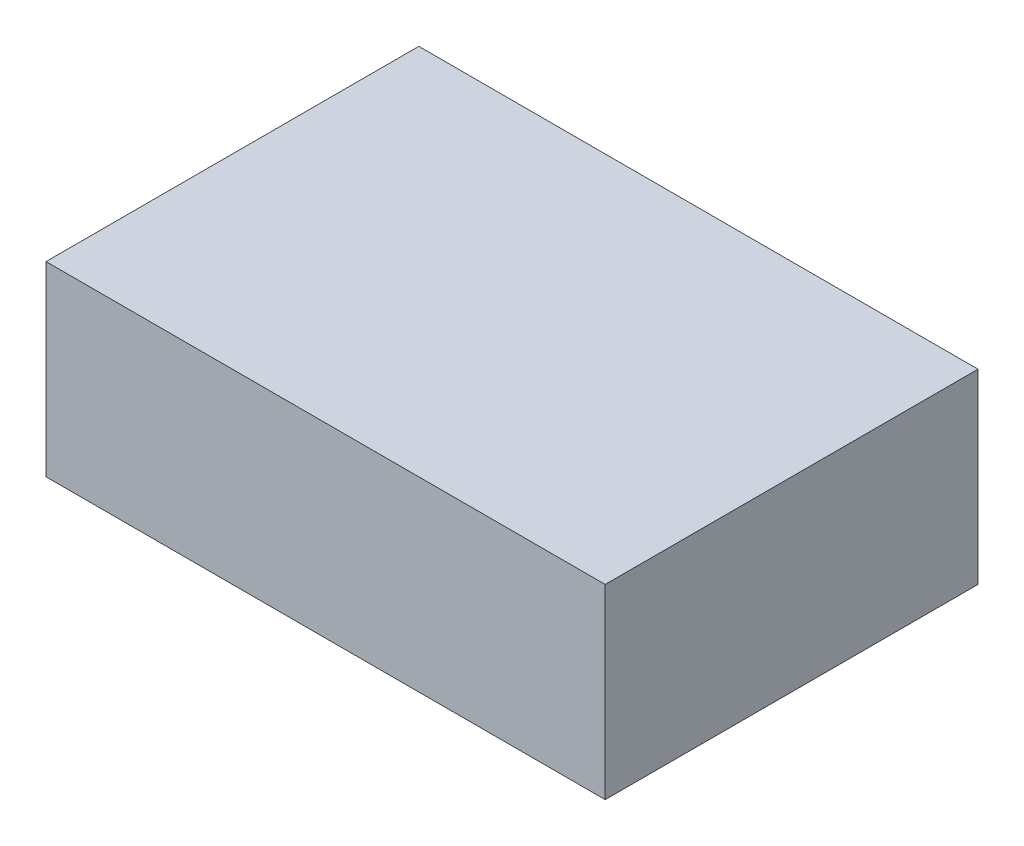
ISO-10303-21;
HEADER;
FILE_DESCRIPTION(('STEP AP214'),'2;1');
FILE_NAME('part.step','',(''),(''),'','','');
FILE_SCHEMA(('AUTOMOTIVE_DESIGN { 1 0 10303 214 1 1 1 1 }'));
ENDSEC;
DATA;
#1=APPLICATION_CONTEXT('core data for automotive mechanical design processes');
#2=APPLICATION_PROTOCOL_DEFINITION('international standard','automotive_design',2000,#1);
#3=PRODUCT_CONTEXT('',#1,'mechanical');
#4=PRODUCT('Part','Part','',(#3));
#5=PRODUCT_RELATED_PRODUCT_CATEGORY('part','',(#4));
#6=PRODUCT_DEFINITION_FORMATION('','',#4);
#7=PRODUCT_DEFINITION_CONTEXT('part definition',#1,'design');
#8=PRODUCT_DEFINITION('design','',#6,#7);
#9=PRODUCT_DEFINITION_SHAPE('','',#8);
#10=(LENGTH_UNIT() NAMED_UNIT(*) SI_UNIT(.MILLI.,.METRE.));
#11=(NAMED_UNIT(*) PLANE_ANGLE_UNIT() SI_UNIT($,.RADIAN.));
#12=(NAMED_UNIT(*) SI_UNIT($,.STERADIAN.) SOLID_ANGLE_UNIT());
#13=UNCERTAINTY_MEASURE_WITH_UNIT(LENGTH_MEASURE(1.E-05),#10,'distance_accuracy_value','');
#14=(GEOMETRIC_REPRESENTATION_CONTEXT(3) GLOBAL_UNCERTAINTY_ASSIGNED_CONTEXT((#13)) GLOBAL_UNIT_ASSIGNED_CONTEXT((#10,
#11,#12)) REPRESENTATION_CONTEXT('',''));
#15=CARTESIAN_POINT('',(0.,0.,0.));
#16=DIRECTION('',(0.,0.,1.));
#17=DIRECTION('',(1.,0.,0.));
#18=AXIS2_PLACEMENT_3D('',#15,#16,#17);
#19=CARTESIAN_POINT('',(152.4,101.6,-101.6));
#20=DIRECTION('',(-1.,0.,0.));
#21=DIRECTION('',(0.,0.,1.));
#22=AXIS2_PLACEMENT_3D('',#19,#20,#21);
#23=PLANE('',#22);
#24=DIRECTION('',(0.,0.,-1.));
#25=VECTOR('',#24,1.);
#26=CARTESIAN_POINT('',(152.4,0.,-101.6));
#27=LINE('',#26,#25);
#28=CARTESIAN_POINT('',(152.4,0.,101.6));
#29=VERTEX_POINT('',#28);
#30=CARTESIAN_POINT('',(152.4,0.,-101.6));
#31=VERTEX_POINT('',#30);
#32=EDGE_CURVE('E100',#29,#31,#27,.T.);
#33=ORIENTED_EDGE('',*,*,#32,.T.);
#34=DIRECTION('',(0.,-1.,0.));
#35=VECTOR('',#34,1.);
#36=CARTESIAN_POINT('',(152.4,101.6,-101.6));
#37=LINE('',#36,#35);
#38=CARTESIAN_POINT('',(152.4,101.6,-101.6));
#39=VERTEX_POINT('',#38);
#40=EDGE_CURVE('E11',#39,#31,#37,.T.);
#41=ORIENTED_EDGE('',*,*,#40,.F.);
#42=DIRECTION('',(0.,0.,-1.));
#43=VECTOR('',#42,1.);
#44=CARTESIAN_POINT('',(152.4,101.6,-101.6));
#45=LINE('',#44,#43);
#46=CARTESIAN_POINT('',(152.4,101.6,101.6));
#47=VERTEX_POINT('',#46);
#48=EDGE_CURVE('E88',#47,#39,#45,.T.);
#49=ORIENTED_EDGE('',*,*,#48,.F.);
#50=DIRECTION('',(0.,-1.,0.));
#51=VECTOR('',#50,1.);
#52=CARTESIAN_POINT('',(152.4,101.6,101.6));
#53=LINE('',#52,#51);
#54=EDGE_CURVE('E96',#47,#29,#53,.T.);
#55=ORIENTED_EDGE('',*,*,#54,.T.);
#56=EDGE_LOOP('',(#33,#41,#49,#55));
#57=FACE_BOUND('',#56,.T.);
#58=ADVANCED_FACE('F37',(#57),#23,.F.);
#59=CARTESIAN_POINT('',(-152.4,101.6,-101.6));
#60=DIRECTION('',(0.,0.,1.));
#61=DIRECTION('',(1.,0.,0.));
#62=AXIS2_PLACEMENT_3D('',#59,#60,#61);
#63=PLANE('',#62);
#64=DIRECTION('',(-1.,0.,0.));
#65=VECTOR('',#64,1.);
#66=CARTESIAN_POINT('',(-152.4,0.,-101.6));
#67=LINE('',#66,#65);
#68=CARTESIAN_POINT('',(-152.4,0.,-101.6));
#69=VERTEX_POINT('',#68);
#70=EDGE_CURVE('E92',#31,#69,#67,.T.);
#71=ORIENTED_EDGE('',*,*,#70,.T.);
#72=DIRECTION('',(0.,-1.,0.));
#73=VECTOR('',#72,1.);
#74=CARTESIAN_POINT('',(-152.4,101.6,-101.6));
#75=LINE('',#74,#73);
#76=CARTESIAN_POINT('',(-152.4,101.6,-101.6));
#77=VERTEX_POINT('',#76);
#78=EDGE_CURVE('E45',#77,#69,#75,.T.);
#79=ORIENTED_EDGE('',*,*,#78,.F.);
#80=DIRECTION('',(-1.,0.,0.));
#81=VECTOR('',#80,1.);
#82=CARTESIAN_POINT('',(-152.4,101.6,-101.6));
#83=LINE('',#82,#81);
#84=EDGE_CURVE('E83',#39,#77,#83,.T.);
#85=ORIENTED_EDGE('',*,*,#84,.F.);
#86=ORIENTED_EDGE('',*,*,#40,.T.);
#87=EDGE_LOOP('',(#71,#79,#85,#86));
#88=FACE_BOUND('',#87,.T.);
#89=ADVANCED_FACE('F91',(#88),#63,.F.);
#90=CARTESIAN_POINT('',(-152.4,101.6,-101.6));
#91=DIRECTION('',(1.,0.,0.));
#92=DIRECTION('',(0.,0.,-1.));
#93=AXIS2_PLACEMENT_3D('',#90,#91,#92);
#94=PLANE('',#93);
#95=DIRECTION('',(0.,0.,1.));
#96=VECTOR('',#95,1.);
#97=CARTESIAN_POINT('',(-152.4,0.,-101.6));
#98=LINE('',#97,#96);
#99=CARTESIAN_POINT('',(-152.4,0.,101.6));
#100=VERTEX_POINT('',#99);
#101=EDGE_CURVE('E70',#69,#100,#98,.T.);
#102=ORIENTED_EDGE('',*,*,#101,.T.);
#103=DIRECTION('',(0.,-1.,0.));
#104=VECTOR('',#103,1.);
#105=CARTESIAN_POINT('',(-152.4,101.6,101.6));
#106=LINE('',#105,#104);
#107=CARTESIAN_POINT('',(-152.4,101.6,101.6));
#108=VERTEX_POINT('',#107);
#109=EDGE_CURVE('E93',#108,#100,#106,.T.);
#110=ORIENTED_EDGE('',*,*,#109,.F.);
#111=DIRECTION('',(0.,0.,1.));
#112=VECTOR('',#111,1.);
#113=CARTESIAN_POINT('',(-152.4,101.6,-101.6));
#114=LINE('',#113,#112);
#115=EDGE_CURVE('E86',#77,#108,#114,.T.);
#116=ORIENTED_EDGE('',*,*,#115,.F.);
#117=ORIENTED_EDGE('',*,*,#78,.T.);
#118=EDGE_LOOP('',(#102,#110,#116,#117));
#119=FACE_BOUND('',#118,.T.);
#120=ADVANCED_FACE('F94',(#119),#94,.F.);
#121=CARTESIAN_POINT('',(-152.4,101.6,101.6));
#122=DIRECTION('',(0.,0.,-1.));
#123=DIRECTION('',(-1.,0.,0.));
#124=AXIS2_PLACEMENT_3D('',#121,#122,#123);
#125=PLANE('',#124);
#126=DIRECTION('',(1.,0.,0.));
#127=VECTOR('',#126,1.);
#128=CARTESIAN_POINT('',(-152.4,0.,101.6));
#129=LINE('',#128,#127);
#130=EDGE_CURVE('E76',#100,#29,#129,.T.);
#131=ORIENTED_EDGE('',*,*,#130,.T.);
#132=ORIENTED_EDGE('',*,*,#54,.F.);
#133=DIRECTION('',(1.,0.,0.));
#134=VECTOR('',#133,1.);
#135=CARTESIAN_POINT('',(-152.4,101.6,101.6));
#136=LINE('',#135,#134);
#137=EDGE_CURVE('E53',#108,#47,#136,.T.);
#138=ORIENTED_EDGE('',*,*,#137,.F.);
#139=ORIENTED_EDGE('',*,*,#109,.T.);
#140=EDGE_LOOP('',(#131,#132,#138,#139));
#141=FACE_BOUND('',#140,.T.);
#142=ADVANCED_FACE('F107',(#141),#125,.F.);
#143=CARTESIAN_POINT('',(0.,101.6,0.));
#144=DIRECTION('',(0.,1.,0.));
#145=DIRECTION('',(0.,0.,1.));
#146=AXIS2_PLACEMENT_3D('',#143,#144,#145);
#147=PLANE('',#146);
#148=ORIENTED_EDGE('',*,*,#48,.T.);
#149=ORIENTED_EDGE('',*,*,#84,.T.);
#150=ORIENTED_EDGE('',*,*,#115,.T.);
#151=ORIENTED_EDGE('',*,*,#137,.T.);
#152=EDGE_LOOP('',(#148,#149,#150,#151));
#153=FACE_BOUND('',#152,.T.);
#154=ADVANCED_FACE('F84',(#153),#147,.T.);
#155=CARTESIAN_POINT('',(0.,0.,0.));
#156=DIRECTION('',(0.,1.,0.));
#157=DIRECTION('',(0.,0.,1.));
#158=AXIS2_PLACEMENT_3D('',#155,#156,#157);
#159=PLANE('',#158);
#160=ORIENTED_EDGE('',*,*,#32,.F.);
#161=ORIENTED_EDGE('',*,*,#130,.F.);
#162=ORIENTED_EDGE('',*,*,#101,.F.);
#163=ORIENTED_EDGE('',*,*,#70,.F.);
#164=EDGE_LOOP('',(#160,#161,#162,#163));
#165=FACE_BOUND('',#164,.T.);
#166=ADVANCED_FACE('F110',(#165),#159,.F.);
#167=CLOSED_SHELL('',(#58,#89,#120,#142,#154,#166));
#168=MANIFOLD_SOLID_BREP('B2',#167);
#169=ADVANCED_BREP_SHAPE_REPRESENTATION('',(#18,#168),#14);
#170=SHAPE_DEFINITION_REPRESENTATION(#9,#169);
ENDSEC;
END-ISO-10303-21;
